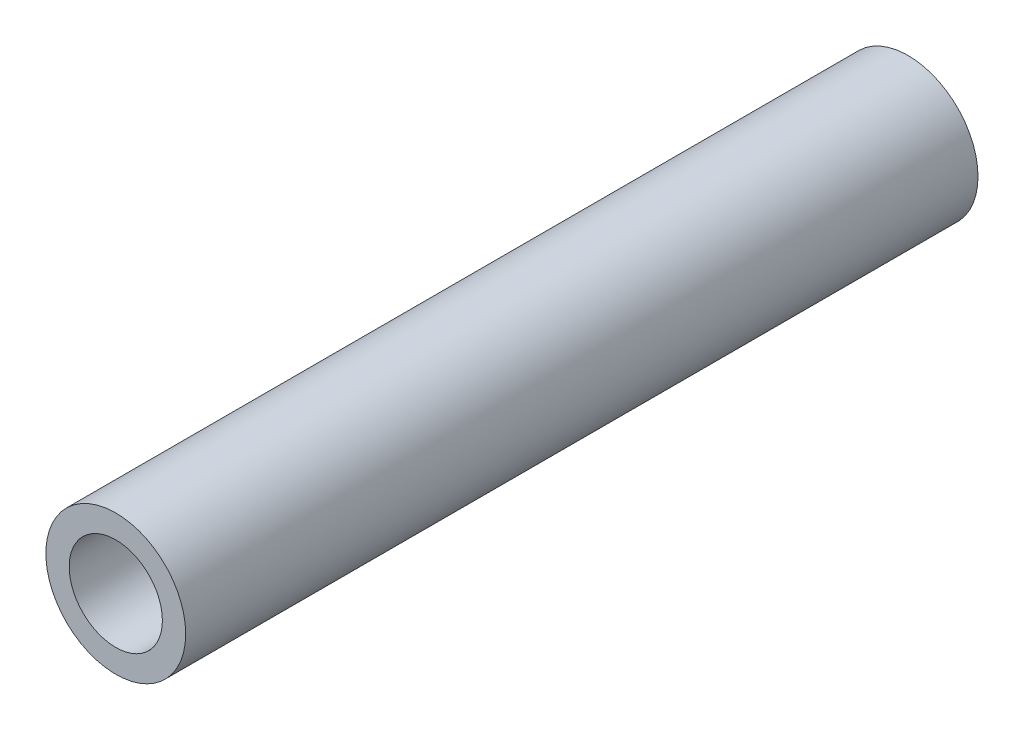
ISO-10303-21;
HEADER;
FILE_DESCRIPTION(('STEP AP214'),'2;1');
FILE_NAME('part.step','',(''),(''),'','','');
FILE_SCHEMA(('AUTOMOTIVE_DESIGN { 1 0 10303 214 1 1 1 1 }'));
ENDSEC;
DATA;
#1=APPLICATION_CONTEXT('core data for automotive mechanical design processes');
#2=APPLICATION_PROTOCOL_DEFINITION('international standard','automotive_design',2000,#1);
#3=PRODUCT_CONTEXT('',#1,'mechanical');
#4=PRODUCT('Part','Part','',(#3));
#5=PRODUCT_RELATED_PRODUCT_CATEGORY('part','',(#4));
#6=PRODUCT_DEFINITION_FORMATION('','',#4);
#7=PRODUCT_DEFINITION_CONTEXT('part definition',#1,'design');
#8=PRODUCT_DEFINITION('design','',#6,#7);
#9=PRODUCT_DEFINITION_SHAPE('','',#8);
#10=(LENGTH_UNIT() NAMED_UNIT(*) SI_UNIT(.MILLI.,.METRE.));
#11=(NAMED_UNIT(*) PLANE_ANGLE_UNIT() SI_UNIT($,.RADIAN.));
#12=(NAMED_UNIT(*) SI_UNIT($,.STERADIAN.) SOLID_ANGLE_UNIT());
#13=UNCERTAINTY_MEASURE_WITH_UNIT(LENGTH_MEASURE(1.E-05),#10,'distance_accuracy_value','');
#14=(GEOMETRIC_REPRESENTATION_CONTEXT(3) GLOBAL_UNCERTAINTY_ASSIGNED_CONTEXT((#13)) GLOBAL_UNIT_ASSIGNED_CONTEXT((#10,
#11,#12)) REPRESENTATION_CONTEXT('',''));
#15=CARTESIAN_POINT('',(0.,0.,0.));
#16=DIRECTION('',(0.,0.,1.));
#17=DIRECTION('',(1.,0.,0.));
#18=AXIS2_PLACEMENT_3D('',#15,#16,#17);
#19=CARTESIAN_POINT('',(0.,0.,17.));
#20=DIRECTION('',(0.,0.,1.));
#21=DIRECTION('',(1.,0.,0.));
#22=AXIS2_PLACEMENT_3D('',#19,#20,#21);
#23=PLANE('',#22);
#24=CARTESIAN_POINT('',(0.,0.,17.));
#25=DIRECTION('',(0.,0.,1.));
#26=DIRECTION('',(1.,0.,0.));
#27=AXIS2_PLACEMENT_3D('',#24,#25,#26);
#28=CIRCLE('',#27,1.5);
#29=CARTESIAN_POINT('',(1.5,0.,17.));
#30=VERTEX_POINT('',#29);
#31=EDGE_CURVE('E10',#30,#30,#28,.T.);
#32=ORIENTED_EDGE('',*,*,#31,.T.);
#33=EDGE_LOOP('',(#32));
#34=FACE_BOUND('',#33,.T.);
#35=CARTESIAN_POINT('',(0.,0.,17.));
#36=DIRECTION('',(0.,0.,1.));
#37=DIRECTION('',(1.,0.,0.));
#38=AXIS2_PLACEMENT_3D('',#35,#36,#37);
#39=CIRCLE('',#38,1.);
#40=CARTESIAN_POINT('',(1.,0.,17.));
#41=VERTEX_POINT('',#40);
#42=EDGE_CURVE('E42',#41,#41,#39,.T.);
#43=ORIENTED_EDGE('',*,*,#42,.F.);
#44=EDGE_LOOP('',(#43));
#45=FACE_BOUND('',#44,.T.);
#46=ADVANCED_FACE('F31',(#34,#45),#23,.T.);
#47=CARTESIAN_POINT('',(0.,0.,0.));
#48=DIRECTION('',(0.,0.,1.));
#49=DIRECTION('',(1.,0.,0.));
#50=AXIS2_PLACEMENT_3D('',#47,#48,#49);
#51=PLANE('',#50);
#52=CARTESIAN_POINT('',(0.,0.,0.));
#53=DIRECTION('',(0.,0.,1.));
#54=DIRECTION('',(1.,0.,0.));
#55=AXIS2_PLACEMENT_3D('',#52,#53,#54);
#56=CIRCLE('',#55,1.5);
#57=CARTESIAN_POINT('',(1.5,0.,0.));
#58=VERTEX_POINT('',#57);
#59=EDGE_CURVE('E35',#58,#58,#56,.T.);
#60=ORIENTED_EDGE('',*,*,#59,.F.);
#61=EDGE_LOOP('',(#60));
#62=FACE_BOUND('',#61,.T.);
#63=CARTESIAN_POINT('',(0.,0.,0.));
#64=DIRECTION('',(0.,0.,1.));
#65=DIRECTION('',(1.,0.,0.));
#66=AXIS2_PLACEMENT_3D('',#63,#64,#65);
#67=CIRCLE('',#66,1.);
#68=CARTESIAN_POINT('',(1.,0.,0.));
#69=VERTEX_POINT('',#68);
#70=EDGE_CURVE('E44',#69,#69,#67,.T.);
#71=ORIENTED_EDGE('',*,*,#70,.T.);
#72=EDGE_LOOP('',(#71));
#73=FACE_BOUND('',#72,.T.);
#74=ADVANCED_FACE('F54',(#62,#73),#51,.F.);
#75=CARTESIAN_POINT('',(0.,0.,17.));
#76=DIRECTION('',(0.,0.,-1.));
#77=DIRECTION('',(-1.,0.,0.));
#78=AXIS2_PLACEMENT_3D('',#75,#76,#77);
#79=CYLINDRICAL_SURFACE('',#78,1.5);
#80=ORIENTED_EDGE('',*,*,#31,.F.);
#81=EDGE_LOOP('',(#80));
#82=FACE_BOUND('',#81,.T.);
#83=ORIENTED_EDGE('',*,*,#59,.T.);
#84=EDGE_LOOP('',(#83));
#85=FACE_BOUND('',#84,.T.);
#86=ADVANCED_FACE('F33',(#82,#85),#79,.T.);
#87=CARTESIAN_POINT('',(0.,0.,17.));
#88=DIRECTION('',(0.,0.,-1.));
#89=DIRECTION('',(-1.,0.,0.));
#90=AXIS2_PLACEMENT_3D('',#87,#88,#89);
#91=CYLINDRICAL_SURFACE('',#90,1.);
#92=ORIENTED_EDGE('',*,*,#42,.T.);
#93=EDGE_LOOP('',(#92));
#94=FACE_BOUND('',#93,.T.);
#95=ORIENTED_EDGE('',*,*,#70,.F.);
#96=EDGE_LOOP('',(#95));
#97=FACE_BOUND('',#96,.T.);
#98=ADVANCED_FACE('F50',(#94,#97),#91,.F.);
#99=CLOSED_SHELL('',(#46,#74,#86,#98));
#100=MANIFOLD_SOLID_BREP('B2',#99);
#101=ADVANCED_BREP_SHAPE_REPRESENTATION('',(#18,#100),#14);
#102=SHAPE_DEFINITION_REPRESENTATION(#9,#101);
ENDSEC;
END-ISO-10303-21;
